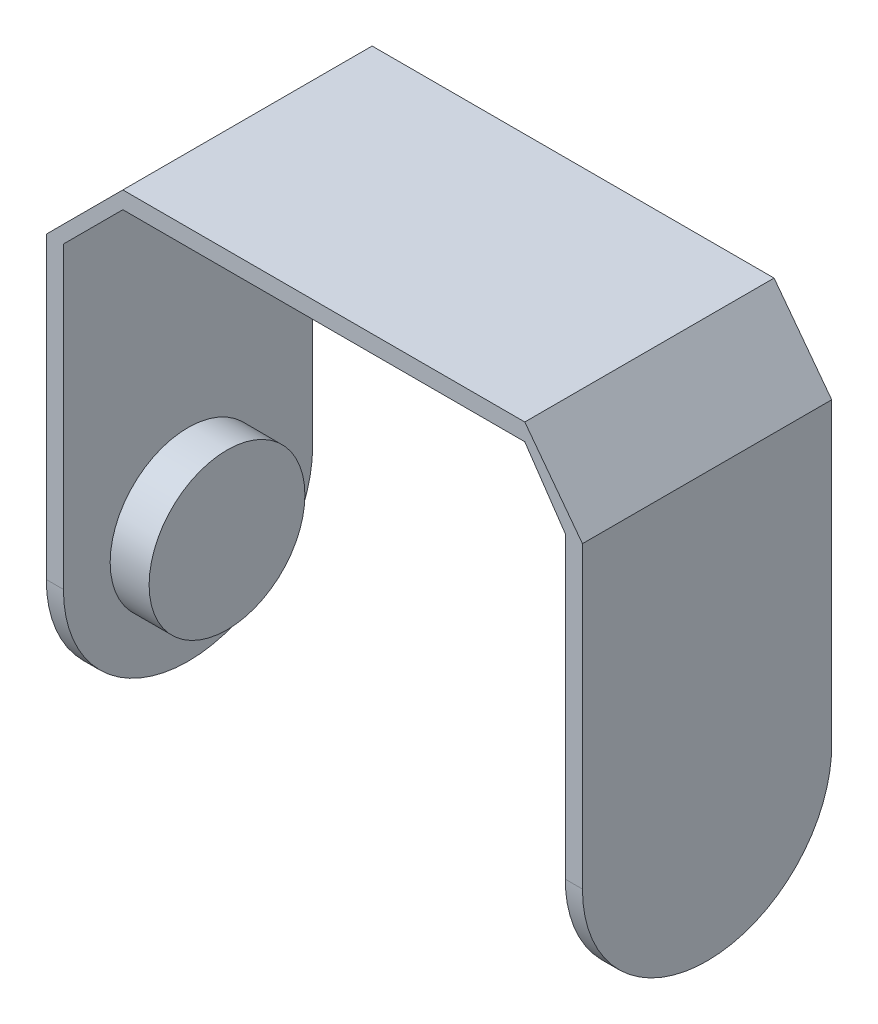
ISO-10303-21;
HEADER;
FILE_DESCRIPTION(('STEP AP214'),'2;1');
FILE_NAME('part.step','',(''),(''),'','','');
FILE_SCHEMA(('AUTOMOTIVE_DESIGN { 1 0 10303 214 1 1 1 1 }'));
ENDSEC;
DATA;
#1=APPLICATION_CONTEXT('core data for automotive mechanical design processes');
#2=APPLICATION_PROTOCOL_DEFINITION('international standard','automotive_design',2000,#1);
#3=PRODUCT_CONTEXT('',#1,'mechanical');
#4=PRODUCT('Part','Part','',(#3));
#5=PRODUCT_RELATED_PRODUCT_CATEGORY('part','',(#4));
#6=PRODUCT_DEFINITION_FORMATION('','',#4);
#7=PRODUCT_DEFINITION_CONTEXT('part definition',#1,'design');
#8=PRODUCT_DEFINITION('design','',#6,#7);
#9=PRODUCT_DEFINITION_SHAPE('','',#8);
#10=(LENGTH_UNIT() NAMED_UNIT(*) SI_UNIT(.MILLI.,.METRE.));
#11=(NAMED_UNIT(*) PLANE_ANGLE_UNIT() SI_UNIT($,.RADIAN.));
#12=(NAMED_UNIT(*) SI_UNIT($,.STERADIAN.) SOLID_ANGLE_UNIT());
#13=UNCERTAINTY_MEASURE_WITH_UNIT(LENGTH_MEASURE(1.E-05),#10,'distance_accuracy_value','');
#14=(GEOMETRIC_REPRESENTATION_CONTEXT(3) GLOBAL_UNCERTAINTY_ASSIGNED_CONTEXT((#13)) GLOBAL_UNIT_ASSIGNED_CONTEXT((#10,
#11,#12)) REPRESENTATION_CONTEXT('',''));
#15=CARTESIAN_POINT('',(0.,0.,0.));
#16=DIRECTION('',(0.,0.,1.));
#17=DIRECTION('',(1.,0.,0.));
#18=AXIS2_PLACEMENT_3D('',#15,#16,#17);
#19=CARTESIAN_POINT('',(-56.8011798622577,64.2288852711708,32.));
#20=DIRECTION('',(0.707106781186548,-0.707106781186547,0.));
#21=DIRECTION('',(0.707106781186547,0.707106781186548,0.));
#22=AXIS2_PLACEMENT_3D('',#19,#20,#21);
#23=PLANE('',#22);
#24=DIRECTION('',(-0.707106781186547,-0.707106781186548,0.));
#25=VECTOR('',#24,1.);
#26=CARTESIAN_POINT('',(-56.8011798622577,64.2288852711708,0.));
#27=LINE('',#26,#25);
#28=CARTESIAN_POINT('',(-56.8011798622577,64.2288852711708,0.));
#29=VERTEX_POINT('',#28);
#30=CARTESIAN_POINT('',(-66.6300651334285,54.4,0.));
#31=VERTEX_POINT('',#30);
#32=EDGE_CURVE('E169',#29,#31,#27,.T.);
#33=ORIENTED_EDGE('',*,*,#32,.T.);
#34=DIRECTION('',(0.,0.,-1.));
#35=VECTOR('',#34,1.);
#36=CARTESIAN_POINT('',(-66.6300651334285,54.4,32.));
#37=LINE('',#36,#35);
#38=CARTESIAN_POINT('',(-66.6300651334285,54.4,32.));
#39=VERTEX_POINT('',#38);
#40=EDGE_CURVE('E148',#39,#31,#37,.T.);
#41=ORIENTED_EDGE('',*,*,#40,.F.);
#42=DIRECTION('',(-0.707106781186547,-0.707106781186548,0.));
#43=VECTOR('',#42,1.);
#44=CARTESIAN_POINT('',(-56.8011798622577,64.2288852711708,32.));
#45=LINE('',#44,#43);
#46=CARTESIAN_POINT('',(-56.8011798622577,64.2288852711708,32.));
#47=VERTEX_POINT('',#46);
#48=EDGE_CURVE('E155',#47,#39,#45,.T.);
#49=ORIENTED_EDGE('',*,*,#48,.F.);
#50=DIRECTION('',(0.,0.,-1.));
#51=VECTOR('',#50,1.);
#52=CARTESIAN_POINT('',(-56.8011798622577,64.2288852711708,32.));
#53=LINE('',#52,#51);
#54=EDGE_CURVE('E251',#47,#29,#53,.T.);
#55=ORIENTED_EDGE('',*,*,#54,.T.);
#56=EDGE_LOOP('',(#33,#41,#49,#55));
#57=FACE_BOUND('',#56,.T.);
#58=ADVANCED_FACE('F41',(#57),#23,.F.);
#59=CARTESIAN_POINT('',(-66.6300651334285,54.4,32.));
#60=DIRECTION('',(1.,0.,0.));
#61=DIRECTION('',(0.,1.,0.));
#62=AXIS2_PLACEMENT_3D('',#59,#60,#61);
#63=PLANE('',#62);
#64=DIRECTION('',(0.,-1.,0.));
#65=VECTOR('',#64,1.);
#66=CARTESIAN_POINT('',(-66.6300651334285,54.4,0.));
#67=LINE('',#66,#65);
#68=CARTESIAN_POINT('',(-66.6300651334285,16.,0.));
#69=VERTEX_POINT('',#68);
#70=EDGE_CURVE('E228',#31,#69,#67,.T.);
#71=ORIENTED_EDGE('',*,*,#70,.T.);
#72=CARTESIAN_POINT('',(-66.6300651334285,16.,16.));
#73=DIRECTION('',(1.,0.,0.));
#74=DIRECTION('',(0.,1.,0.));
#75=AXIS2_PLACEMENT_3D('',#72,#73,#74);
#76=CIRCLE('',#75,16.);
#77=CARTESIAN_POINT('',(-66.6300651334285,0.,16.));
#78=VERTEX_POINT('',#77);
#79=EDGE_CURVE('E185',#69,#78,#76,.F.);
#80=ORIENTED_EDGE('',*,*,#79,.T.);
#81=CARTESIAN_POINT('',(-66.6300651334285,16.,16.));
#82=DIRECTION('',(1.,0.,0.));
#83=DIRECTION('',(0.,1.,0.));
#84=AXIS2_PLACEMENT_3D('',#81,#82,#83);
#85=CIRCLE('',#84,16.);
#86=CARTESIAN_POINT('',(-66.6300651334285,16.,32.));
#87=VERTEX_POINT('',#86);
#88=EDGE_CURVE('E151',#78,#87,#85,.F.);
#89=ORIENTED_EDGE('',*,*,#88,.T.);
#90=DIRECTION('',(0.,-1.,0.));
#91=VECTOR('',#90,1.);
#92=CARTESIAN_POINT('',(-66.6300651334285,54.4,32.));
#93=LINE('',#92,#91);
#94=EDGE_CURVE('E143',#39,#87,#93,.T.);
#95=ORIENTED_EDGE('',*,*,#94,.F.);
#96=ORIENTED_EDGE('',*,*,#40,.T.);
#97=EDGE_LOOP('',(#71,#80,#89,#95,#96));
#98=FACE_BOUND('',#97,.T.);
#99=ADVANCED_FACE('F146',(#98),#63,.F.);
#100=CARTESIAN_POINT('',(-64.4300651334285,0.,32.));
#101=DIRECTION('',(-1.,0.,0.));
#102=DIRECTION('',(0.,0.,1.));
#103=AXIS2_PLACEMENT_3D('',#100,#101,#102);
#104=PLANE('',#103);
#105=CARTESIAN_POINT('',(-64.4300651334285,16.,16.));
#106=DIRECTION('',(-1.,0.,0.));
#107=DIRECTION('',(0.,0.,1.));
#108=AXIS2_PLACEMENT_3D('',#105,#106,#107);
#109=CIRCLE('',#108,10.);
#110=CARTESIAN_POINT('',(-64.4300651334285,16.,26.));
#111=VERTEX_POINT('',#110);
#112=EDGE_CURVE('E49',#111,#111,#109,.F.);
#113=ORIENTED_EDGE('',*,*,#112,.F.);
#114=EDGE_LOOP('',(#113));
#115=FACE_BOUND('',#114,.T.);
#116=CARTESIAN_POINT('',(-64.4300651334285,16.,16.));
#117=DIRECTION('',(-1.,0.,0.));
#118=DIRECTION('',(0.,0.,1.));
#119=AXIS2_PLACEMENT_3D('',#116,#117,#118);
#120=CIRCLE('',#119,16.);
#121=CARTESIAN_POINT('',(-64.4300651334285,16.,32.));
#122=VERTEX_POINT('',#121);
#123=CARTESIAN_POINT('',(-64.4300651334285,0.,16.));
#124=VERTEX_POINT('',#123);
#125=EDGE_CURVE('E170',#122,#124,#120,.F.);
#126=ORIENTED_EDGE('',*,*,#125,.T.);
#127=CARTESIAN_POINT('',(-64.4300651334285,16.,16.));
#128=DIRECTION('',(-1.,0.,0.));
#129=DIRECTION('',(0.,0.,1.));
#130=AXIS2_PLACEMENT_3D('',#127,#128,#129);
#131=CIRCLE('',#130,16.);
#132=CARTESIAN_POINT('',(-64.4300651334285,16.,0.));
#133=VERTEX_POINT('',#132);
#134=EDGE_CURVE('E173',#124,#133,#131,.F.);
#135=ORIENTED_EDGE('',*,*,#134,.T.);
#136=DIRECTION('',(0.,1.,0.));
#137=VECTOR('',#136,1.);
#138=CARTESIAN_POINT('',(-64.4300651334285,0.,0.));
#139=LINE('',#138,#137);
#140=CARTESIAN_POINT('',(-64.4300651334285,54.4,0.));
#141=VERTEX_POINT('',#140);
#142=EDGE_CURVE('E230',#133,#141,#139,.T.);
#143=ORIENTED_EDGE('',*,*,#142,.T.);
#144=DIRECTION('',(0.,0.,-1.));
#145=VECTOR('',#144,1.);
#146=CARTESIAN_POINT('',(-64.4300651334285,54.4,32.));
#147=LINE('',#146,#145);
#148=CARTESIAN_POINT('',(-64.4300651334285,54.4,32.));
#149=VERTEX_POINT('',#148);
#150=EDGE_CURVE('E171',#149,#141,#147,.T.);
#151=ORIENTED_EDGE('',*,*,#150,.F.);
#152=DIRECTION('',(0.,1.,0.));
#153=VECTOR('',#152,1.);
#154=CARTESIAN_POINT('',(-64.4300651334285,0.,32.));
#155=LINE('',#154,#153);
#156=EDGE_CURVE('E154',#122,#149,#155,.T.);
#157=ORIENTED_EDGE('',*,*,#156,.F.);
#158=EDGE_LOOP('',(#126,#135,#143,#151,#157));
#159=FACE_BOUND('',#158,.T.);
#160=ADVANCED_FACE('F211',(#115,#159),#104,.F.);
#161=CARTESIAN_POINT('',(-64.4300651334285,54.4,32.));
#162=DIRECTION('',(-0.707106781186547,0.707106781186547,0.));
#163=DIRECTION('',(-0.707106781186548,-0.707106781186548,0.));
#164=AXIS2_PLACEMENT_3D('',#161,#162,#163);
#165=PLANE('',#164);
#166=DIRECTION('',(0.707106781186547,0.707106781186547,0.));
#167=VECTOR('',#166,1.);
#168=CARTESIAN_POINT('',(-64.4300651334285,54.4,0.));
#169=LINE('',#168,#167);
#170=CARTESIAN_POINT('',(-56.8011798622577,62.0288852711708,0.));
#171=VERTEX_POINT('',#170);
#172=EDGE_CURVE('E232',#141,#171,#169,.T.);
#173=ORIENTED_EDGE('',*,*,#172,.T.);
#174=DIRECTION('',(0.,0.,-1.));
#175=VECTOR('',#174,1.);
#176=CARTESIAN_POINT('',(-56.8011798622577,62.0288852711708,32.));
#177=LINE('',#176,#175);
#178=CARTESIAN_POINT('',(-56.8011798622577,62.0288852711708,32.));
#179=VERTEX_POINT('',#178);
#180=EDGE_CURVE('E176',#179,#171,#177,.T.);
#181=ORIENTED_EDGE('',*,*,#180,.F.);
#182=DIRECTION('',(0.707106781186547,0.707106781186547,0.));
#183=VECTOR('',#182,1.);
#184=CARTESIAN_POINT('',(-64.4300651334285,54.4,32.));
#185=LINE('',#184,#183);
#186=EDGE_CURVE('E283',#149,#179,#185,.T.);
#187=ORIENTED_EDGE('',*,*,#186,.F.);
#188=ORIENTED_EDGE('',*,*,#150,.T.);
#189=EDGE_LOOP('',(#173,#181,#187,#188));
#190=FACE_BOUND('',#189,.T.);
#191=ADVANCED_FACE('F214',(#190),#165,.F.);
#192=CARTESIAN_POINT('',(-56.8011798622577,62.0288852711708,32.));
#193=DIRECTION('',(0.,1.,0.));
#194=DIRECTION('',(0.,0.,1.));
#195=AXIS2_PLACEMENT_3D('',#192,#193,#194);
#196=PLANE('',#195);
#197=DIRECTION('',(1.,0.,0.));
#198=VECTOR('',#197,1.);
#199=CARTESIAN_POINT('',(-56.8011798622577,62.0288852711708,0.));
#200=LINE('',#199,#198);
#201=CARTESIAN_POINT('',(-5.20117986225772,62.0288852711708,0.));
#202=VERTEX_POINT('',#201);
#203=EDGE_CURVE('E238',#171,#202,#200,.T.);
#204=ORIENTED_EDGE('',*,*,#203,.T.);
#205=DIRECTION('',(0.,0.,-1.));
#206=VECTOR('',#205,1.);
#207=CARTESIAN_POINT('',(-5.20117986225772,62.0288852711708,32.));
#208=LINE('',#207,#206);
#209=CARTESIAN_POINT('',(-5.20117986225772,62.0288852711708,32.));
#210=VERTEX_POINT('',#209);
#211=EDGE_CURVE('E260',#210,#202,#208,.T.);
#212=ORIENTED_EDGE('',*,*,#211,.F.);
#213=DIRECTION('',(1.,0.,0.));
#214=VECTOR('',#213,1.);
#215=CARTESIAN_POINT('',(-56.8011798622577,62.0288852711708,32.));
#216=LINE('',#215,#214);
#217=EDGE_CURVE('E269',#179,#210,#216,.T.);
#218=ORIENTED_EDGE('',*,*,#217,.F.);
#219=ORIENTED_EDGE('',*,*,#180,.T.);
#220=EDGE_LOOP('',(#204,#212,#218,#219));
#221=FACE_BOUND('',#220,.T.);
#222=ADVANCED_FACE('F267',(#221),#196,.F.);
#223=CARTESIAN_POINT('',(-5.20117986225772,62.0288852711708,32.));
#224=DIRECTION('',(0.826244119964504,0.563312217357375,0.));
#225=DIRECTION('',(-0.563312217357375,0.826244119964504,0.));
#226=AXIS2_PLACEMENT_3D('',#223,#224,#225);
#227=PLANE('',#226);
#228=DIRECTION('',(0.563312217357375,-0.826244119964504,0.));
#229=VECTOR('',#228,1.);
#230=CARTESIAN_POINT('',(-5.20117986225772,62.0288852711708,0.));
#231=LINE('',#230,#229);
#232=CARTESIAN_POINT('',(0.,54.4,0.));
#233=VERTEX_POINT('',#232);
#234=EDGE_CURVE('E240',#202,#233,#231,.T.);
#235=ORIENTED_EDGE('',*,*,#234,.T.);
#236=DIRECTION('',(0.,0.,-1.));
#237=VECTOR('',#236,1.);
#238=CARTESIAN_POINT('',(0.,54.4,32.));
#239=LINE('',#238,#237);
#240=CARTESIAN_POINT('',(0.,54.4,32.));
#241=VERTEX_POINT('',#240);
#242=EDGE_CURVE('E257',#241,#233,#239,.T.);
#243=ORIENTED_EDGE('',*,*,#242,.F.);
#244=DIRECTION('',(0.563312217357375,-0.826244119964504,0.));
#245=VECTOR('',#244,1.);
#246=CARTESIAN_POINT('',(-5.20117986225772,62.0288852711708,32.));
#247=LINE('',#246,#245);
#248=EDGE_CURVE('E278',#210,#241,#247,.T.);
#249=ORIENTED_EDGE('',*,*,#248,.F.);
#250=ORIENTED_EDGE('',*,*,#211,.T.);
#251=EDGE_LOOP('',(#235,#243,#249,#250));
#252=FACE_BOUND('',#251,.T.);
#253=ADVANCED_FACE('F275',(#252),#227,.F.);
#254=CARTESIAN_POINT('',(0.,0.,32.));
#255=DIRECTION('',(-1.,0.,0.));
#256=DIRECTION('',(0.,0.,1.));
#257=AXIS2_PLACEMENT_3D('',#254,#255,#256);
#258=PLANE('',#257);
#259=CARTESIAN_POINT('',(0.,16.,16.));
#260=DIRECTION('',(-1.,0.,0.));
#261=DIRECTION('',(0.,0.,1.));
#262=AXIS2_PLACEMENT_3D('',#259,#260,#261);
#263=CIRCLE('',#262,10.);
#264=CARTESIAN_POINT('',(0.,16.,26.));
#265=VERTEX_POINT('',#264);
#266=EDGE_CURVE('E11',#265,#265,#263,.T.);
#267=ORIENTED_EDGE('',*,*,#266,.F.);
#268=EDGE_LOOP('',(#267));
#269=FACE_BOUND('',#268,.T.);
#270=CARTESIAN_POINT('',(0.,16.0000001256873,16.));
#271=DIRECTION('',(-1.,0.,0.));
#272=DIRECTION('',(0.,1.,0.));
#273=AXIS2_PLACEMENT_3D('',#270,#271,#272);
#274=ELLIPSE('',#273,16.0000001256873,16.);
#275=CARTESIAN_POINT('',(0.,16.0000001256873,0.));
#276=VERTEX_POINT('',#275);
#277=CARTESIAN_POINT('',(0.,0.,16.));
#278=VERTEX_POINT('',#277);
#279=EDGE_CURVE('E56',#276,#278,#274,.T.);
#280=ORIENTED_EDGE('',*,*,#279,.T.);
#281=CARTESIAN_POINT('',(0.,16.0000001256873,16.));
#282=DIRECTION('',(-1.,0.,0.));
#283=DIRECTION('',(0.,-1.,0.));
#284=AXIS2_PLACEMENT_3D('',#281,#282,#283);
#285=ELLIPSE('',#284,16.0000001256873,16.);
#286=CARTESIAN_POINT('',(0.,16.0000001256873,32.));
#287=VERTEX_POINT('',#286);
#288=EDGE_CURVE('E201',#278,#287,#285,.T.);
#289=ORIENTED_EDGE('',*,*,#288,.T.);
#290=DIRECTION('',(0.,1.,0.));
#291=VECTOR('',#290,1.);
#292=CARTESIAN_POINT('',(0.,0.,32.));
#293=LINE('',#292,#291);
#294=EDGE_CURVE('E279',#287,#241,#293,.T.);
#295=ORIENTED_EDGE('',*,*,#294,.T.);
#296=ORIENTED_EDGE('',*,*,#242,.T.);
#297=DIRECTION('',(0.,1.,0.));
#298=VECTOR('',#297,1.);
#299=CARTESIAN_POINT('',(0.,0.,0.));
#300=LINE('',#299,#298);
#301=EDGE_CURVE('E243',#276,#233,#300,.T.);
#302=ORIENTED_EDGE('',*,*,#301,.F.);
#303=EDGE_LOOP('',(#280,#289,#295,#296,#302));
#304=FACE_BOUND('',#303,.T.);
#305=ADVANCED_FACE('F336',(#269,#304),#258,.T.);
#306=CARTESIAN_POINT('',(2.2,54.4,32.));
#307=DIRECTION('',(1.,0.,0.));
#308=DIRECTION('',(0.,1.,0.));
#309=AXIS2_PLACEMENT_3D('',#306,#307,#308);
#310=PLANE('',#309);
#311=DIRECTION('',(0.,-1.,0.));
#312=VECTOR('',#311,1.);
#313=CARTESIAN_POINT('',(2.2,54.4,32.));
#314=LINE('',#313,#312);
#315=CARTESIAN_POINT('',(2.2,54.4,32.));
#316=VERTEX_POINT('',#315);
#317=CARTESIAN_POINT('',(2.20000000000001,16.0002758807109,32.));
#318=VERTEX_POINT('',#317);
#319=EDGE_CURVE('E281',#316,#318,#314,.T.);
#320=ORIENTED_EDGE('',*,*,#319,.T.);
#321=CARTESIAN_POINT('',(2.20000000000001,16.0002758807109,16.));
#322=DIRECTION('',(1.,0.,0.));
#323=DIRECTION('',(0.,-1.,0.));
#324=AXIS2_PLACEMENT_3D('',#321,#322,#323);
#325=ELLIPSE('',#324,16.0000001256873,16.);
#326=CARTESIAN_POINT('',(2.20000000000001,0.000275755023536288,16.));
#327=VERTEX_POINT('',#326);
#328=EDGE_CURVE('E198',#318,#327,#325,.T.);
#329=ORIENTED_EDGE('',*,*,#328,.T.);
#330=CARTESIAN_POINT('',(2.20000000000001,16.0002758807109,16.));
#331=DIRECTION('',(1.,0.,0.));
#332=DIRECTION('',(0.,1.,0.));
#333=AXIS2_PLACEMENT_3D('',#330,#331,#332);
#334=ELLIPSE('',#333,16.0000001256873,16.);
#335=CARTESIAN_POINT('',(2.20000000000001,16.0002758807109,0.));
#336=VERTEX_POINT('',#335);
#337=EDGE_CURVE('E196',#327,#336,#334,.T.);
#338=ORIENTED_EDGE('',*,*,#337,.T.);
#339=DIRECTION('',(0.,-1.,0.));
#340=VECTOR('',#339,1.);
#341=CARTESIAN_POINT('',(2.2,54.4,0.));
#342=LINE('',#341,#340);
#343=CARTESIAN_POINT('',(2.2,54.4,0.));
#344=VERTEX_POINT('',#343);
#345=EDGE_CURVE('E245',#344,#336,#342,.T.);
#346=ORIENTED_EDGE('',*,*,#345,.F.);
#347=DIRECTION('',(0.,0.,-1.));
#348=VECTOR('',#347,1.);
#349=CARTESIAN_POINT('',(2.2,54.4,32.));
#350=LINE('',#349,#348);
#351=EDGE_CURVE('E255',#316,#344,#350,.T.);
#352=ORIENTED_EDGE('',*,*,#351,.F.);
#353=EDGE_LOOP('',(#320,#329,#338,#346,#352));
#354=FACE_BOUND('',#353,.T.);
#355=ADVANCED_FACE('F298',(#354),#310,.T.);
#356=CARTESIAN_POINT('',(-5.20117986225772,64.2288852711708,32.));
#357=DIRECTION('',(0.798847045794215,0.601534203039075,0.));
#358=DIRECTION('',(-0.601534203039075,0.798847045794215,0.));
#359=AXIS2_PLACEMENT_3D('',#356,#357,#358);
#360=PLANE('',#359);
#361=DIRECTION('',(0.601534203039075,-0.798847045794215,0.));
#362=VECTOR('',#361,1.);
#363=CARTESIAN_POINT('',(-5.20117986225772,64.2288852711708,0.));
#364=LINE('',#363,#362);
#365=CARTESIAN_POINT('',(-5.20117986225772,64.2288852711708,0.));
#366=VERTEX_POINT('',#365);
#367=EDGE_CURVE('E247',#366,#344,#364,.T.);
#368=ORIENTED_EDGE('',*,*,#367,.F.);
#369=DIRECTION('',(0.,0.,-1.));
#370=VECTOR('',#369,1.);
#371=CARTESIAN_POINT('',(-5.20117986225772,64.2288852711708,32.));
#372=LINE('',#371,#370);
#373=CARTESIAN_POINT('',(-5.20117986225772,64.2288852711708,32.));
#374=VERTEX_POINT('',#373);
#375=EDGE_CURVE('E253',#374,#366,#372,.T.);
#376=ORIENTED_EDGE('',*,*,#375,.F.);
#377=DIRECTION('',(0.601534203039075,-0.798847045794215,0.));
#378=VECTOR('',#377,1.);
#379=CARTESIAN_POINT('',(-5.20117986225772,64.2288852711708,32.));
#380=LINE('',#379,#378);
#381=EDGE_CURVE('E289',#374,#316,#380,.T.);
#382=ORIENTED_EDGE('',*,*,#381,.T.);
#383=ORIENTED_EDGE('',*,*,#351,.T.);
#384=EDGE_LOOP('',(#368,#376,#382,#383));
#385=FACE_BOUND('',#384,.T.);
#386=ADVANCED_FACE('F293',(#385),#360,.T.);
#387=CARTESIAN_POINT('',(-5.20117986225772,64.2288852711708,32.));
#388=DIRECTION('',(0.,-1.,0.));
#389=DIRECTION('',(0.,0.,-1.));
#390=AXIS2_PLACEMENT_3D('',#387,#388,#389);
#391=PLANE('',#390);
#392=DIRECTION('',(-1.,0.,0.));
#393=VECTOR('',#392,1.);
#394=CARTESIAN_POINT('',(-5.20117986225772,64.2288852711708,0.));
#395=LINE('',#394,#393);
#396=EDGE_CURVE('E166',#366,#29,#395,.T.);
#397=ORIENTED_EDGE('',*,*,#396,.T.);
#398=ORIENTED_EDGE('',*,*,#54,.F.);
#399=DIRECTION('',(-1.,0.,0.));
#400=VECTOR('',#399,1.);
#401=CARTESIAN_POINT('',(-5.20117986225772,64.2288852711708,32.));
#402=LINE('',#401,#400);
#403=EDGE_CURVE('E162',#374,#47,#402,.T.);
#404=ORIENTED_EDGE('',*,*,#403,.F.);
#405=ORIENTED_EDGE('',*,*,#375,.T.);
#406=EDGE_LOOP('',(#397,#398,#404,#405));
#407=FACE_BOUND('',#406,.T.);
#408=ADVANCED_FACE('F302',(#407),#391,.F.);
#409=CARTESIAN_POINT('',(0.,0.,32.));
#410=DIRECTION('',(0.,0.,1.));
#411=DIRECTION('',(1.,0.,0.));
#412=AXIS2_PLACEMENT_3D('',#409,#410,#411);
#413=PLANE('',#412);
#414=ORIENTED_EDGE('',*,*,#294,.F.);
#415=DIRECTION('',(0.999999992144542,0.000125343191531866,0.));
#416=VECTOR('',#415,1.);
#417=CARTESIAN_POINT('',(2.1979945089355,16.0002756293362,32.));
#418=LINE('',#417,#416);
#419=EDGE_CURVE('E189',#287,#318,#418,.T.);
#420=ORIENTED_EDGE('',*,*,#419,.T.);
#421=ORIENTED_EDGE('',*,*,#319,.F.);
#422=ORIENTED_EDGE('',*,*,#381,.F.);
#423=ORIENTED_EDGE('',*,*,#403,.T.);
#424=ORIENTED_EDGE('',*,*,#48,.T.);
#425=ORIENTED_EDGE('',*,*,#94,.T.);
#426=DIRECTION('',(1.,0.,0.));
#427=VECTOR('',#426,1.);
#428=CARTESIAN_POINT('',(-64.4300651334285,16.,32.));
#429=LINE('',#428,#427);
#430=EDGE_CURVE('E187',#87,#122,#429,.T.);
#431=ORIENTED_EDGE('',*,*,#430,.T.);
#432=ORIENTED_EDGE('',*,*,#156,.T.);
#433=ORIENTED_EDGE('',*,*,#186,.T.);
#434=ORIENTED_EDGE('',*,*,#217,.T.);
#435=ORIENTED_EDGE('',*,*,#248,.T.);
#436=EDGE_LOOP('',(#414,#420,#421,#422,#423,#424,#425,#431,#432,#433,#434,#435));
#437=FACE_BOUND('',#436,.T.);
#438=ADVANCED_FACE('F159',(#437),#413,.T.);
#439=CARTESIAN_POINT('',(0.,0.,0.));
#440=DIRECTION('',(0.,0.,1.));
#441=DIRECTION('',(1.,0.,0.));
#442=AXIS2_PLACEMENT_3D('',#439,#440,#441);
#443=PLANE('',#442);
#444=ORIENTED_EDGE('',*,*,#345,.T.);
#445=DIRECTION('',(0.999999992144542,0.000125343191531866,0.));
#446=VECTOR('',#445,1.);
#447=CARTESIAN_POINT('',(-0.00200549106450986,15.9999998743127,0.));
#448=LINE('',#447,#446);
#449=EDGE_CURVE('E64',#336,#276,#448,.F.);
#450=ORIENTED_EDGE('',*,*,#449,.T.);
#451=ORIENTED_EDGE('',*,*,#301,.T.);
#452=ORIENTED_EDGE('',*,*,#234,.F.);
#453=ORIENTED_EDGE('',*,*,#203,.F.);
#454=ORIENTED_EDGE('',*,*,#172,.F.);
#455=ORIENTED_EDGE('',*,*,#142,.F.);
#456=DIRECTION('',(1.,0.,0.));
#457=VECTOR('',#456,1.);
#458=CARTESIAN_POINT('',(0.,16.,0.));
#459=LINE('',#458,#457);
#460=EDGE_CURVE('E181',#133,#69,#459,.F.);
#461=ORIENTED_EDGE('',*,*,#460,.T.);
#462=ORIENTED_EDGE('',*,*,#70,.F.);
#463=ORIENTED_EDGE('',*,*,#32,.F.);
#464=ORIENTED_EDGE('',*,*,#396,.F.);
#465=ORIENTED_EDGE('',*,*,#367,.T.);
#466=EDGE_LOOP('',(#444,#450,#451,#452,#453,#454,#455,#461,#462,#463,#464,#465));
#467=FACE_BOUND('',#466,.T.);
#468=ADVANCED_FACE('F227',(#467),#443,.F.);
#469=CARTESIAN_POINT('',(0.,16.,16.));
#470=DIRECTION('',(-1.,0.,0.));
#471=DIRECTION('',(0.,0.,1.));
#472=AXIS2_PLACEMENT_3D('',#469,#470,#471);
#473=CYLINDRICAL_SURFACE('',#472,16.);
#474=ORIENTED_EDGE('',*,*,#430,.F.);
#475=ORIENTED_EDGE('',*,*,#88,.F.);
#476=DIRECTION('',(1.,0.,0.));
#477=VECTOR('',#476,1.);
#478=CARTESIAN_POINT('',(-66.6300651334285,0.,16.));
#479=LINE('',#478,#477);
#480=EDGE_CURVE('E190',#124,#78,#479,.F.);
#481=ORIENTED_EDGE('',*,*,#480,.F.);
#482=ORIENTED_EDGE('',*,*,#125,.F.);
#483=EDGE_LOOP('',(#474,#475,#481,#482));
#484=FACE_BOUND('',#483,.T.);
#485=ADVANCED_FACE('F223',(#484),#473,.T.);
#486=CARTESIAN_POINT('',(-66.6300651334285,16.,16.));
#487=DIRECTION('',(1.,0.,0.));
#488=DIRECTION('',(0.,0.,-1.));
#489=AXIS2_PLACEMENT_3D('',#486,#487,#488);
#490=CYLINDRICAL_SURFACE('',#489,16.);
#491=ORIENTED_EDGE('',*,*,#79,.F.);
#492=ORIENTED_EDGE('',*,*,#460,.F.);
#493=ORIENTED_EDGE('',*,*,#134,.F.);
#494=ORIENTED_EDGE('',*,*,#480,.T.);
#495=EDGE_LOOP('',(#491,#492,#493,#494));
#496=FACE_BOUND('',#495,.T.);
#497=ADVANCED_FACE('F226',(#496),#490,.T.);
#498=CARTESIAN_POINT('',(-0.00200549106450986,15.9999998743127,16.));
#499=DIRECTION('',(0.999999992144542,0.000125343191531866,0.));
#500=DIRECTION('',(-0.000125343191531866,0.999999992144542,0.));
#501=AXIS2_PLACEMENT_3D('',#498,#499,#500);
#502=CYLINDRICAL_SURFACE('',#501,16.);
#503=DIRECTION('',(0.999999992144542,0.000125343191531866,0.));
#504=VECTOR('',#503,1.);
#505=CARTESIAN_POINT('',(0.,0.,16.));
#506=LINE('',#505,#504);
#507=EDGE_CURVE('E193',#278,#327,#506,.T.);
#508=ORIENTED_EDGE('',*,*,#507,.F.);
#509=ORIENTED_EDGE('',*,*,#279,.F.);
#510=ORIENTED_EDGE('',*,*,#449,.F.);
#511=ORIENTED_EDGE('',*,*,#337,.F.);
#512=EDGE_LOOP('',(#508,#509,#510,#511));
#513=FACE_BOUND('',#512,.T.);
#514=ADVANCED_FACE('F43',(#513),#502,.T.);
#515=CARTESIAN_POINT('',(-0.00200549106450986,15.9999998743127,16.));
#516=DIRECTION('',(-0.999999992144542,-0.000125343191531866,0.));
#517=DIRECTION('',(0.000125343191531866,-0.999999992144542,0.));
#518=AXIS2_PLACEMENT_3D('',#515,#516,#517);
#519=CYLINDRICAL_SURFACE('',#518,16.);
#520=ORIENTED_EDGE('',*,*,#288,.F.);
#521=ORIENTED_EDGE('',*,*,#507,.T.);
#522=ORIENTED_EDGE('',*,*,#328,.F.);
#523=ORIENTED_EDGE('',*,*,#419,.F.);
#524=EDGE_LOOP('',(#520,#521,#522,#523));
#525=FACE_BOUND('',#524,.T.);
#526=ADVANCED_FACE('F324',(#525),#519,.T.);
#527=CARTESIAN_POINT('',(-59.4300651334285,16.,16.));
#528=DIRECTION('',(-1.,0.,0.));
#529=DIRECTION('',(0.,0.,1.));
#530=AXIS2_PLACEMENT_3D('',#527,#528,#529);
#531=CYLINDRICAL_SURFACE('',#530,10.);
#532=CARTESIAN_POINT('',(-59.4300651334285,16.,16.));
#533=DIRECTION('',(1.,0.,0.));
#534=DIRECTION('',(0.,0.,-1.));
#535=AXIS2_PLACEMENT_3D('',#532,#533,#534);
#536=CIRCLE('',#535,10.);
#537=CARTESIAN_POINT('',(-59.4300651334285,16.,6.));
#538=VERTEX_POINT('',#537);
#539=EDGE_CURVE('E205',#538,#538,#536,.T.);
#540=ORIENTED_EDGE('',*,*,#539,.F.);
#541=EDGE_LOOP('',(#540));
#542=FACE_BOUND('',#541,.T.);
#543=ORIENTED_EDGE('',*,*,#112,.T.);
#544=EDGE_LOOP('',(#543));
#545=FACE_BOUND('',#544,.T.);
#546=ADVANCED_FACE('F209',(#542,#545),#531,.T.);
#547=CARTESIAN_POINT('',(-59.4300651334285,16.,16.));
#548=DIRECTION('',(1.,0.,0.));
#549=DIRECTION('',(0.,0.,-1.));
#550=AXIS2_PLACEMENT_3D('',#547,#548,#549);
#551=PLANE('',#550);
#552=ORIENTED_EDGE('',*,*,#539,.T.);
#553=EDGE_LOOP('',(#552));
#554=FACE_BOUND('',#553,.T.);
#555=ADVANCED_FACE('F331',(#554),#551,.T.);
#556=CARTESIAN_POINT('',(-5.,16.,16.));
#557=DIRECTION('',(1.,0.,0.));
#558=DIRECTION('',(0.,0.,-1.));
#559=AXIS2_PLACEMENT_3D('',#556,#557,#558);
#560=CYLINDRICAL_SURFACE('',#559,10.);
#561=CARTESIAN_POINT('',(-5.,16.,16.));
#562=DIRECTION('',(1.,0.,0.));
#563=DIRECTION('',(0.,0.,-1.));
#564=AXIS2_PLACEMENT_3D('',#561,#562,#563);
#565=CIRCLE('',#564,10.);
#566=CARTESIAN_POINT('',(-5.,16.,6.));
#567=VERTEX_POINT('',#566);
#568=EDGE_CURVE('E360',#567,#567,#565,.T.);
#569=ORIENTED_EDGE('',*,*,#568,.T.);
#570=EDGE_LOOP('',(#569));
#571=FACE_BOUND('',#570,.T.);
#572=ORIENTED_EDGE('',*,*,#266,.T.);
#573=EDGE_LOOP('',(#572));
#574=FACE_BOUND('',#573,.T.);
#575=ADVANCED_FACE('F364',(#571,#574),#560,.T.);
#576=CARTESIAN_POINT('',(-5.,16.,16.));
#577=DIRECTION('',(-1.,0.,0.));
#578=DIRECTION('',(0.,0.,-1.));
#579=AXIS2_PLACEMENT_3D('',#576,#577,#578);
#580=PLANE('',#579);
#581=ORIENTED_EDGE('',*,*,#568,.F.);
#582=EDGE_LOOP('',(#581));
#583=FACE_BOUND('',#582,.T.);
#584=ADVANCED_FACE('F367',(#583),#580,.T.);
#585=CLOSED_SHELL('',(#58,#99,#160,#191,#222,#253,#305,#355,#386,#408,#438,#468,#485,#497,#514,
#526,#546,#555,#575,#584));
#586=MANIFOLD_SOLID_BREP('B2',#585);
#587=ADVANCED_BREP_SHAPE_REPRESENTATION('',(#18,#586),#14);
#588=SHAPE_DEFINITION_REPRESENTATION(#9,#587);
ENDSEC;
END-ISO-10303-21;
